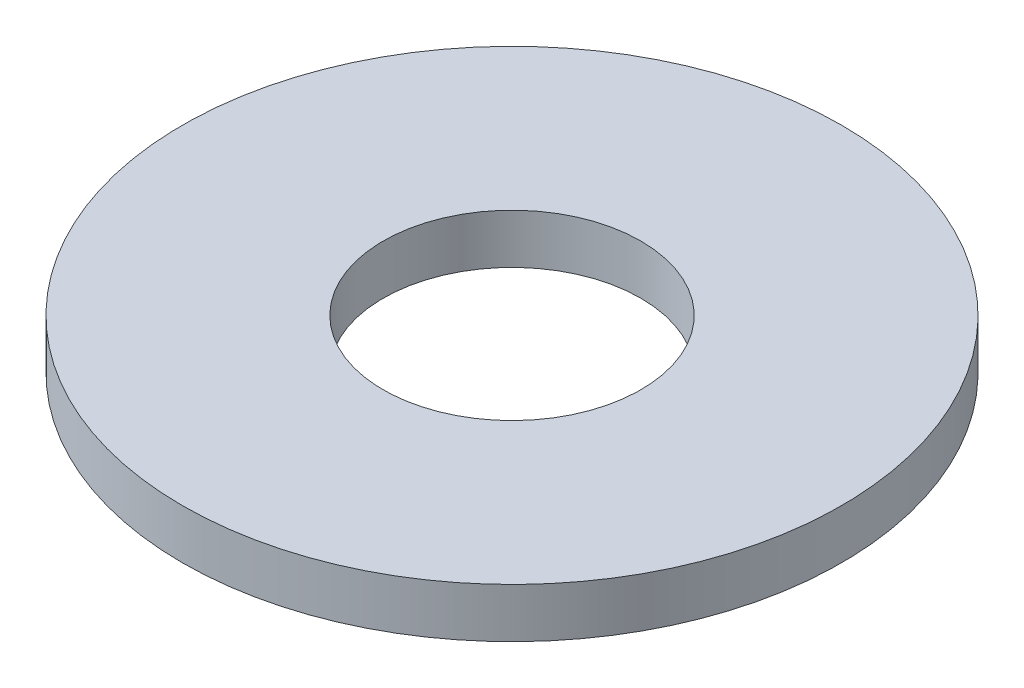
ISO-10303-21;
HEADER;
FILE_DESCRIPTION(('STEP AP214'),'2;1');
FILE_NAME('part.step','',(''),(''),'','','');
FILE_SCHEMA(('AUTOMOTIVE_DESIGN { 1 0 10303 214 1 1 1 1 }'));
ENDSEC;
DATA;
#1=APPLICATION_CONTEXT('core data for automotive mechanical design processes');
#2=APPLICATION_PROTOCOL_DEFINITION('international standard','automotive_design',2000,#1);
#3=PRODUCT_CONTEXT('',#1,'mechanical');
#4=PRODUCT('Part','Part','',(#3));
#5=PRODUCT_RELATED_PRODUCT_CATEGORY('part','',(#4));
#6=PRODUCT_DEFINITION_FORMATION('','',#4);
#7=PRODUCT_DEFINITION_CONTEXT('part definition',#1,'design');
#8=PRODUCT_DEFINITION('design','',#6,#7);
#9=PRODUCT_DEFINITION_SHAPE('','',#8);
#10=(LENGTH_UNIT() NAMED_UNIT(*) SI_UNIT(.MILLI.,.METRE.));
#11=(NAMED_UNIT(*) PLANE_ANGLE_UNIT() SI_UNIT($,.RADIAN.));
#12=(NAMED_UNIT(*) SI_UNIT($,.STERADIAN.) SOLID_ANGLE_UNIT());
#13=UNCERTAINTY_MEASURE_WITH_UNIT(LENGTH_MEASURE(1.E-05),#10,'distance_accuracy_value','');
#14=(GEOMETRIC_REPRESENTATION_CONTEXT(3) GLOBAL_UNCERTAINTY_ASSIGNED_CONTEXT((#13)) GLOBAL_UNIT_ASSIGNED_CONTEXT((#10,
#11,#12)) REPRESENTATION_CONTEXT('',''));
#15=CARTESIAN_POINT('',(0.,0.,0.));
#16=DIRECTION('',(0.,0.,1.));
#17=DIRECTION('',(1.,0.,0.));
#18=AXIS2_PLACEMENT_3D('',#15,#16,#17);
#19=CARTESIAN_POINT('',(0.,1.27,0.));
#20=DIRECTION('',(0.,-1.,0.));
#21=DIRECTION('',(0.,0.,-1.));
#22=AXIS2_PLACEMENT_3D('',#19,#20,#21);
#23=CYLINDRICAL_SURFACE('',#22,8.4455);
#24=CARTESIAN_POINT('',(0.,1.27,0.));
#25=DIRECTION('',(0.,1.,0.));
#26=DIRECTION('',(0.,0.,1.));
#27=AXIS2_PLACEMENT_3D('',#24,#25,#26);
#28=CIRCLE('',#27,8.4455);
#29=CARTESIAN_POINT('',(0.,1.27,8.4455));
#30=VERTEX_POINT('',#29);
#31=EDGE_CURVE('E10',#30,#30,#28,.T.);
#32=ORIENTED_EDGE('',*,*,#31,.F.);
#33=EDGE_LOOP('',(#32));
#34=FACE_BOUND('',#33,.T.);
#35=CARTESIAN_POINT('',(0.,0.,0.));
#36=DIRECTION('',(0.,1.,0.));
#37=DIRECTION('',(0.,0.,1.));
#38=AXIS2_PLACEMENT_3D('',#35,#36,#37);
#39=CIRCLE('',#38,8.4455);
#40=CARTESIAN_POINT('',(0.,0.,8.4455));
#41=VERTEX_POINT('',#40);
#42=EDGE_CURVE('E34',#41,#41,#39,.T.);
#43=ORIENTED_EDGE('',*,*,#42,.T.);
#44=EDGE_LOOP('',(#43));
#45=FACE_BOUND('',#44,.T.);
#46=ADVANCED_FACE('F31',(#34,#45),#23,.T.);
#47=CARTESIAN_POINT('',(0.,1.27,0.));
#48=DIRECTION('',(0.,1.,0.));
#49=DIRECTION('',(0.,0.,1.));
#50=AXIS2_PLACEMENT_3D('',#47,#48,#49);
#51=PLANE('',#50);
#52=CARTESIAN_POINT('',(0.,1.27,0.));
#53=DIRECTION('',(0.,-1.,0.));
#54=DIRECTION('',(0.,0.,-1.));
#55=AXIS2_PLACEMENT_3D('',#52,#53,#54);
#56=CIRCLE('',#55,3.302);
#57=CARTESIAN_POINT('',(0.,1.27,-3.302));
#58=VERTEX_POINT('',#57);
#59=EDGE_CURVE('E41',#58,#58,#56,.T.);
#60=ORIENTED_EDGE('',*,*,#59,.T.);
#61=EDGE_LOOP('',(#60));
#62=FACE_BOUND('',#61,.T.);
#63=ORIENTED_EDGE('',*,*,#31,.T.);
#64=EDGE_LOOP('',(#63));
#65=FACE_BOUND('',#64,.T.);
#66=ADVANCED_FACE('F49',(#62,#65),#51,.T.);
#67=CARTESIAN_POINT('',(0.,0.,0.));
#68=DIRECTION('',(0.,1.,0.));
#69=DIRECTION('',(0.,0.,1.));
#70=AXIS2_PLACEMENT_3D('',#67,#68,#69);
#71=PLANE('',#70);
#72=CARTESIAN_POINT('',(0.,0.,0.));
#73=DIRECTION('',(0.,-1.,0.));
#74=DIRECTION('',(0.,0.,-1.));
#75=AXIS2_PLACEMENT_3D('',#72,#73,#74);
#76=CIRCLE('',#75,3.302);
#77=CARTESIAN_POINT('',(0.,0.,-3.302));
#78=VERTEX_POINT('',#77);
#79=EDGE_CURVE('E43',#78,#78,#76,.T.);
#80=ORIENTED_EDGE('',*,*,#79,.F.);
#81=EDGE_LOOP('',(#80));
#82=FACE_BOUND('',#81,.T.);
#83=ORIENTED_EDGE('',*,*,#42,.F.);
#84=EDGE_LOOP('',(#83));
#85=FACE_BOUND('',#84,.T.);
#86=ADVANCED_FACE('F54',(#82,#85),#71,.F.);
#87=CARTESIAN_POINT('',(0.,1.27,0.));
#88=DIRECTION('',(0.,-1.,0.));
#89=DIRECTION('',(0.,0.,-1.));
#90=AXIS2_PLACEMENT_3D('',#87,#88,#89);
#91=CYLINDRICAL_SURFACE('',#90,3.302);
#92=ORIENTED_EDGE('',*,*,#59,.F.);
#93=EDGE_LOOP('',(#92));
#94=FACE_BOUND('',#93,.T.);
#95=ORIENTED_EDGE('',*,*,#79,.T.);
#96=EDGE_LOOP('',(#95));
#97=FACE_BOUND('',#96,.T.);
#98=ADVANCED_FACE('F51',(#94,#97),#91,.F.);
#99=CLOSED_SHELL('',(#46,#66,#86,#98));
#100=MANIFOLD_SOLID_BREP('B2',#99);
#101=ADVANCED_BREP_SHAPE_REPRESENTATION('',(#18,#100),#14);
#102=SHAPE_DEFINITION_REPRESENTATION(#9,#101);
ENDSEC;
END-ISO-10303-21;
